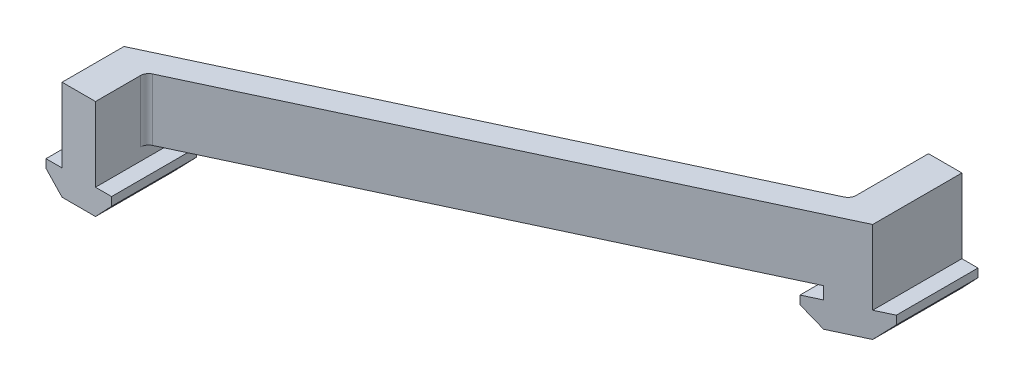
ISO-10303-21;
HEADER;
FILE_DESCRIPTION(('STEP AP214'),'2;1');
FILE_NAME('part.step','',(''),(''),'','','');
FILE_SCHEMA(('AUTOMOTIVE_DESIGN { 1 0 10303 214 1 1 1 1 }'));
ENDSEC;
DATA;
#1=APPLICATION_CONTEXT('core data for automotive mechanical design processes');
#2=APPLICATION_PROTOCOL_DEFINITION('international standard','automotive_design',2000,#1);
#3=PRODUCT_CONTEXT('',#1,'mechanical');
#4=PRODUCT('Part','Part','',(#3));
#5=PRODUCT_RELATED_PRODUCT_CATEGORY('part','',(#4));
#6=PRODUCT_DEFINITION_FORMATION('','',#4);
#7=PRODUCT_DEFINITION_CONTEXT('part definition',#1,'design');
#8=PRODUCT_DEFINITION('design','',#6,#7);
#9=PRODUCT_DEFINITION_SHAPE('','',#8);
#10=(LENGTH_UNIT() NAMED_UNIT(*) SI_UNIT(.MILLI.,.METRE.));
#11=(NAMED_UNIT(*) PLANE_ANGLE_UNIT() SI_UNIT($,.RADIAN.));
#12=(NAMED_UNIT(*) SI_UNIT($,.STERADIAN.) SOLID_ANGLE_UNIT());
#13=UNCERTAINTY_MEASURE_WITH_UNIT(LENGTH_MEASURE(1.E-05),#10,'distance_accuracy_value','');
#14=(GEOMETRIC_REPRESENTATION_CONTEXT(3) GLOBAL_UNCERTAINTY_ASSIGNED_CONTEXT((#13)) GLOBAL_UNIT_ASSIGNED_CONTEXT((#10,
#11,#12)) REPRESENTATION_CONTEXT('',''));
#15=CARTESIAN_POINT('',(0.,0.,0.));
#16=DIRECTION('',(0.,0.,1.));
#17=DIRECTION('',(1.,0.,0.));
#18=AXIS2_PLACEMENT_3D('',#15,#16,#17);
#19=CARTESIAN_POINT('',(0.728649883730893,-6.1524149839237,1.55566750176542));
#20=DIRECTION('',(-0.424162175987541,0.,-0.9055862457334));
#21=DIRECTION('',(-0.9055862457334,0.,0.424162175987541));
#22=AXIS2_PLACEMENT_3D('',#19,#20,#21);
#23=PLANE('',#22);
#24=DIRECTION('',(-0.9055862457334,0.,0.424162175987541));
#25=VECTOR('',#24,1.);
#26=CARTESIAN_POINT('',(0.728649883730893,-6.1524149839237,1.55566750176542));
#27=LINE('',#26,#25);
#28=CARTESIAN_POINT('',(4.04799999999999,-6.15241498392369,0.000936768149918232));
#29=VERTEX_POINT('',#28);
#30=CARTESIAN_POINT('',(-4.048,-6.15241498392371,3.79297423887591));
#31=VERTEX_POINT('',#30);
#32=EDGE_CURVE('E348',#29,#31,#27,.T.);
#33=ORIENTED_EDGE('',*,*,#32,.T.);
#34=DIRECTION('',(0.905586220574988,0.00023571742963929,-0.424162164203742));
#35=VECTOR('',#34,1.);
#36=CARTESIAN_POINT('',(0.728649618327297,-6.15117165717609,1.55566762607624));
#37=LINE('',#36,#35);
#38=CARTESIAN_POINT('',(4.05000000000006,-6.15030713411124,0.));
#39=VERTEX_POINT('',#38);
#40=EDGE_CURVE('E440',#31,#39,#37,.T.);
#41=ORIENTED_EDGE('',*,*,#40,.T.);
#42=DIRECTION('',(0.655101911491755,0.690428220608852,-0.306839302806443));
#43=VECTOR('',#42,1.);
#44=CARTESIAN_POINT('',(-6.96696368434923,-17.7613595515539,5.16017034395753));
#45=LINE('',#44,#43);
#46=EDGE_CURVE('E357',#29,#39,#45,.T.);
#47=ORIENTED_EDGE('',*,*,#46,.F.);
#48=EDGE_LOOP('',(#33,#41,#47));
#49=FACE_BOUND('',#48,.T.);
#50=ADVANCED_FACE('F69',(#49),#23,.T.);
#51=DIRECTION('',(-0.9055862457334,0.,0.424162175987541));
#52=VECTOR('',#51,1.);
#53=CARTESIAN_POINT('',(0.728649883730827,18.,1.55566750176542));
#54=LINE('',#53,#52);
#55=CARTESIAN_POINT('',(-5.20167564802492,18.,4.33333754005851));
#56=VERTEX_POINT('',#55);
#57=CARTESIAN_POINT('',(-124.05,17.9999999999997,60.));
#58=VERTEX_POINT('',#57);
#59=EDGE_CURVE('E334',#56,#58,#54,.T.);
#60=ORIENTED_EDGE('',*,*,#59,.F.);
#61=DIRECTION('',(0.,-1.,0.));
#62=VECTOR('',#61,1.);
#63=CARTESIAN_POINT('',(-5.20167564802492,-6.15241498392369,4.33333754005854));
#64=LINE('',#63,#62);
#65=CARTESIAN_POINT('',(-5.20167564802491,3.00000000000001,4.33333754005852));
#66=VERTEX_POINT('',#65);
#67=EDGE_CURVE('E310',#56,#66,#64,.T.);
#68=ORIENTED_EDGE('',*,*,#67,.T.);
#69=DIRECTION('',(-0.9055862457334,0.,0.424162175987541));
#70=VECTOR('',#69,1.);
#71=CARTESIAN_POINT('',(-22.3182760683492,3.00000000000001,12.3504805940746));
#72=LINE('',#71,#70);
#73=CARTESIAN_POINT('',(-115.95,3.,56.2060889929743));
#74=VERTEX_POINT('',#73);
#75=EDGE_CURVE('E354',#66,#74,#72,.T.);
#76=ORIENTED_EDGE('',*,*,#75,.T.);
#77=DIRECTION('',(0.,1.,0.));
#78=VECTOR('',#77,1.);
#79=CARTESIAN_POINT('',(-115.95,0.,56.2060889929743));
#80=LINE('',#79,#78);
#81=CARTESIAN_POINT('',(-115.95,0.,56.2060889929743));
#82=VERTEX_POINT('',#81);
#83=EDGE_CURVE('E458',#82,#74,#80,.T.);
#84=ORIENTED_EDGE('',*,*,#83,.F.);
#85=DIRECTION('',(0.9055862457334,0.,-0.424162175987541));
#86=VECTOR('',#85,1.);
#87=CARTESIAN_POINT('',(-119.970694106482,0.,58.0893180826613));
#88=LINE('',#87,#86);
#89=CARTESIAN_POINT('',(-112.05,0.,54.3793911007026));
#90=VERTEX_POINT('',#89);
#91=EDGE_CURVE('E307',#82,#90,#88,.T.);
#92=ORIENTED_EDGE('',*,*,#91,.T.);
#93=DIRECTION('',(0.,-1.,0.));
#94=VECTOR('',#93,1.);
#95=CARTESIAN_POINT('',(-112.05,-2.04000000000002,54.3793911007026));
#96=LINE('',#95,#94);
#97=CARTESIAN_POINT('',(-112.05,-2.04,54.3793911007026));
#98=VERTEX_POINT('',#97);
#99=EDGE_CURVE('E452',#90,#98,#96,.T.);
#100=ORIENTED_EDGE('',*,*,#99,.T.);
#101=DIRECTION('',(-0.655101911491755,-0.690428220608851,0.306839302806444));
#102=VECTOR('',#101,1.);
#103=CARTESIAN_POINT('',(-119.729594803873,-10.1337162331902,57.9763910088397));
#104=LINE('',#103,#102);
#105=CARTESIAN_POINT('',(-115.952,-6.15241498392406,56.2070257611243));
#106=VERTEX_POINT('',#105);
#107=EDGE_CURVE('E455',#98,#106,#104,.T.);
#108=ORIENTED_EDGE('',*,*,#107,.T.);
#109=DIRECTION('',(-0.9055862457334,0.,0.424162175987541));
#110=VECTOR('',#109,1.);
#111=CARTESIAN_POINT('',(4.05000000000006,-6.15241498392373,0.));
#112=LINE('',#111,#110);
#113=CARTESIAN_POINT('',(-124.048,-6.15241498392408,59.9990632318502));
#114=VERTEX_POINT('',#113);
#115=EDGE_CURVE('E449',#106,#114,#112,.T.);
#116=ORIENTED_EDGE('',*,*,#115,.T.);
#117=DIRECTION('',(-0.655101911491756,0.69042822060885,0.306839302806443));
#118=VECTOR('',#117,1.);
#119=CARTESIAN_POINT('',(-130.597978811627,0.750770820617105,63.0669689984202));
#120=LINE('',#119,#118);
#121=CARTESIAN_POINT('',(-127.95,-2.04,61.8266978922717));
#122=VERTEX_POINT('',#121);
#123=EDGE_CURVE('E461',#114,#122,#120,.T.);
#124=ORIENTED_EDGE('',*,*,#123,.T.);
#125=DIRECTION('',(0.,1.,0.));
#126=VECTOR('',#125,1.);
#127=CARTESIAN_POINT('',(-127.95,0.,61.8266978922717));
#128=LINE('',#127,#126);
#129=CARTESIAN_POINT('',(-127.95,0.,61.8266978922717));
#130=VERTEX_POINT('',#129);
#131=EDGE_CURVE('E464',#122,#130,#128,.T.);
#132=ORIENTED_EDGE('',*,*,#131,.T.);
#133=DIRECTION('',(0.9055862457334,0.,-0.424162175987541));
#134=VECTOR('',#133,1.);
#135=CARTESIAN_POINT('',(-129.81173148802,0.,62.6987032730773));
#136=LINE('',#135,#134);
#137=CARTESIAN_POINT('',(-124.05,0.,60.));
#138=VERTEX_POINT('',#137);
#139=EDGE_CURVE('E467',#130,#138,#136,.T.);
#140=ORIENTED_EDGE('',*,*,#139,.T.);
#141=DIRECTION('',(0.,1.,0.));
#142=VECTOR('',#141,1.);
#143=CARTESIAN_POINT('',(-124.05,18.,60.));
#144=LINE('',#143,#142);
#145=EDGE_CURVE('E345',#138,#58,#144,.T.);
#146=ORIENTED_EDGE('',*,*,#145,.T.);
#147=EDGE_LOOP('',(#60,#68,#76,#84,#92,#100,#108,#116,#124,#132,#140,#146));
#148=FACE_BOUND('',#147,.T.);
#149=ADVANCED_FACE('F342',(#148),#23,.T.);
#150=CARTESIAN_POINT('',(3.27362293965614,-6.15241498392369,6.98918497616583));
#151=DIRECTION('',(-0.424162175987541,0.,-0.9055862457334));
#152=DIRECTION('',(-0.9055862457334,0.,0.424162175987541));
#153=AXIS2_PLACEMENT_3D('',#150,#151,#152);
#154=PLANE('',#153);
#155=DIRECTION('',(-0.9055862457334,0.,0.424162175987541));
#156=VECTOR('',#155,1.);
#157=CARTESIAN_POINT('',(3.27362293965608,18.,6.98918497616583));
#158=LINE('',#157,#156);
#159=CARTESIAN_POINT('',(4.05,18.,6.62554232495087));
#160=VERTEX_POINT('',#159);
#161=CARTESIAN_POINT('',(-114.798324351975,17.9999999999997,62.2922047848924));
#162=VERTEX_POINT('',#161);
#163=EDGE_CURVE('E237',#160,#162,#158,.T.);
#164=ORIENTED_EDGE('',*,*,#163,.T.);
#165=DIRECTION('',(0.,1.,0.));
#166=VECTOR('',#165,1.);
#167=CARTESIAN_POINT('',(-114.798324351975,-6.15241498392362,62.2922047848924));
#168=LINE('',#167,#166);
#169=CARTESIAN_POINT('',(-114.798324351975,3.,62.2922047848924));
#170=VERTEX_POINT('',#169);
#171=EDGE_CURVE('E91',#162,#170,#168,.F.);
#172=ORIENTED_EDGE('',*,*,#171,.T.);
#173=DIRECTION('',(-0.9055862457334,0.,0.424162175987541));
#174=VECTOR('',#173,1.);
#175=CARTESIAN_POINT('',(-19.7733030124239,3.00000000000001,17.783998068475));
#176=LINE('',#175,#174);
#177=CARTESIAN_POINT('',(-4.05,3.00000000000001,10.4194533319766));
#178=VERTEX_POINT('',#177);
#179=EDGE_CURVE('E270',#178,#170,#176,.T.);
#180=ORIENTED_EDGE('',*,*,#179,.F.);
#181=DIRECTION('',(0.,1.,0.));
#182=VECTOR('',#181,1.);
#183=CARTESIAN_POINT('',(-4.05,0.,10.4194533319766));
#184=LINE('',#183,#182);
#185=CARTESIAN_POINT('',(-4.05,0.,10.4194533319766));
#186=VERTEX_POINT('',#185);
#187=EDGE_CURVE('E910',#186,#178,#184,.T.);
#188=ORIENTED_EDGE('',*,*,#187,.F.);
#189=DIRECTION('',(-0.9055862457334,0.,0.424162175987541));
#190=VECTOR('',#189,1.);
#191=CARTESIAN_POINT('',(-19.7733030124239,0.,17.783998068475));
#192=LINE('',#191,#190);
#193=CARTESIAN_POINT('',(-7.95,0.,12.2461512242483));
#194=VERTEX_POINT('',#193);
#195=EDGE_CURVE('E904',#186,#194,#192,.T.);
#196=ORIENTED_EDGE('',*,*,#195,.T.);
#197=DIRECTION('',(0.,1.,0.));
#198=VECTOR('',#197,1.);
#199=CARTESIAN_POINT('',(-7.95,-6.15241498392408,12.2461512242483));
#200=LINE('',#199,#198);
#201=CARTESIAN_POINT('',(-7.95,-2.04,12.2461512242483));
#202=VERTEX_POINT('',#201);
#203=EDGE_CURVE('E950',#202,#194,#200,.T.);
#204=ORIENTED_EDGE('',*,*,#203,.F.);
#205=DIRECTION('',(0.655101911491755,-0.690428220608852,-0.306839302806443));
#206=VECTOR('',#205,1.);
#207=CARTESIAN_POINT('',(-15.0599330929756,5.45333556797741,15.5763306588973));
#208=LINE('',#207,#206);
#209=CARTESIAN_POINT('',(-4.048,-6.15241498392371,10.4185165638268));
#210=VERTEX_POINT('',#209);
#211=EDGE_CURVE('E256',#202,#210,#208,.T.);
#212=ORIENTED_EDGE('',*,*,#211,.T.);
#213=DIRECTION('',(-0.9055862457334,0.,0.424162175987541));
#214=VECTOR('',#213,1.);
#215=CARTESIAN_POINT('',(3.27362293965614,-6.15241498392369,6.98918497616583));
#216=LINE('',#215,#214);
#217=CARTESIAN_POINT('',(4.04799999999999,-6.15241498392369,6.62647909310079));
#218=VERTEX_POINT('',#217);
#219=EDGE_CURVE('E245',#218,#210,#216,.T.);
#220=ORIENTED_EDGE('',*,*,#219,.F.);
#221=DIRECTION('',(0.655101911491755,0.690428220608851,-0.306839302806443));
#222=VECTOR('',#221,1.);
#223=CARTESIAN_POINT('',(-5.63515670470695,-16.3577350054813,11.1619154887481));
#224=LINE('',#223,#222);
#225=CARTESIAN_POINT('',(7.95,-2.04,4.79884443267921));
#226=VERTEX_POINT('',#225);
#227=EDGE_CURVE('E264',#218,#226,#224,.T.);
#228=ORIENTED_EDGE('',*,*,#227,.T.);
#229=DIRECTION('',(0.,1.,0.));
#230=VECTOR('',#229,1.);
#231=CARTESIAN_POINT('',(7.95,-6.15241498392408,4.79884443267921));
#232=LINE('',#231,#230);
#233=CARTESIAN_POINT('',(7.95,0.,4.79884443267921));
#234=VERTEX_POINT('',#233);
#235=EDGE_CURVE('E949',#226,#234,#232,.T.);
#236=ORIENTED_EDGE('',*,*,#235,.T.);
#237=DIRECTION('',(-0.9055862457334,0.,0.424162175987541));
#238=VECTOR('',#237,1.);
#239=CARTESIAN_POINT('',(-19.7733030124239,0.,17.783998068475));
#240=LINE('',#239,#238);
#241=CARTESIAN_POINT('',(4.05,0.,6.62554232495087));
#242=VERTEX_POINT('',#241);
#243=EDGE_CURVE('E252',#234,#242,#240,.T.);
#244=ORIENTED_EDGE('',*,*,#243,.T.);
#245=DIRECTION('',(0.,1.,0.));
#246=VECTOR('',#245,1.);
#247=CARTESIAN_POINT('',(4.05,0.,6.62554232495087));
#248=LINE('',#247,#246);
#249=EDGE_CURVE('E249',#242,#160,#248,.T.);
#250=ORIENTED_EDGE('',*,*,#249,.T.);
#251=EDGE_LOOP('',(#164,#172,#180,#188,#196,#204,#212,#220,#228,#236,#244,#250));
#252=FACE_BOUND('',#251,.T.);
#253=ADVANCED_FACE('F250',(#252),#154,.F.);
#254=CARTESIAN_POINT('',(-115.95,0.,60.));
#255=DIRECTION('',(1.,0.,0.));
#256=DIRECTION('',(0.,0.,-1.));
#257=AXIS2_PLACEMENT_3D('',#254,#255,#256);
#258=PLANE('',#257);
#259=DIRECTION('',(0.,0.,-1.));
#260=VECTOR('',#259,1.);
#261=CARTESIAN_POINT('',(-115.95,3.,60.));
#262=LINE('',#261,#260);
#263=CARTESIAN_POINT('',(-115.95,3.,64.1033772763592));
#264=VERTEX_POINT('',#263);
#265=EDGE_CURVE('E299',#264,#74,#262,.T.);
#266=ORIENTED_EDGE('',*,*,#265,.F.);
#267=DIRECTION('',(0.,1.,0.));
#268=VECTOR('',#267,1.);
#269=CARTESIAN_POINT('',(-115.95,0.,64.1033772763592));
#270=LINE('',#269,#268);
#271=CARTESIAN_POINT('',(-115.95,18.,64.1033772763592));
#272=VERTEX_POINT('',#271);
#273=EDGE_CURVE('E317',#264,#272,#270,.T.);
#274=ORIENTED_EDGE('',*,*,#273,.T.);
#275=DIRECTION('',(0.,0.,-1.));
#276=VECTOR('',#275,1.);
#277=CARTESIAN_POINT('',(-115.95,18.,75.));
#278=LINE('',#277,#276);
#279=CARTESIAN_POINT('',(-115.95,18.,75.));
#280=VERTEX_POINT('',#279);
#281=EDGE_CURVE('E371',#280,#272,#278,.T.);
#282=ORIENTED_EDGE('',*,*,#281,.F.);
#283=DIRECTION('',(0.,1.,0.));
#284=VECTOR('',#283,1.);
#285=CARTESIAN_POINT('',(-115.95,0.,75.));
#286=LINE('',#285,#284);
#287=CARTESIAN_POINT('',(-115.95,0.,75.));
#288=VERTEX_POINT('',#287);
#289=EDGE_CURVE('E377',#288,#280,#286,.T.);
#290=ORIENTED_EDGE('',*,*,#289,.F.);
#291=DIRECTION('',(0.,0.,-1.));
#292=VECTOR('',#291,1.);
#293=CARTESIAN_POINT('',(-115.95,0.,60.));
#294=LINE('',#293,#292);
#295=EDGE_CURVE('E303',#288,#82,#294,.T.);
#296=ORIENTED_EDGE('',*,*,#295,.T.);
#297=ORIENTED_EDGE('',*,*,#83,.T.);
#298=EDGE_LOOP('',(#266,#274,#282,#290,#296,#297));
#299=FACE_BOUND('',#298,.T.);
#300=ADVANCED_FACE('F369',(#299),#258,.T.);
#301=CARTESIAN_POINT('',(0.,18.,60.));
#302=DIRECTION('',(0.,-1.,0.));
#303=DIRECTION('',(1.,0.,0.));
#304=AXIS2_PLACEMENT_3D('',#301,#302,#303);
#305=PLANE('',#304);
#306=ORIENTED_EDGE('',*,*,#163,.F.);
#307=DIRECTION('',(0.,0.,-1.));
#308=VECTOR('',#307,1.);
#309=CARTESIAN_POINT('',(4.05,18.,60.));
#310=LINE('',#309,#308);
#311=CARTESIAN_POINT('',(4.05,18.,-15.));
#312=VERTEX_POINT('',#311);
#313=EDGE_CURVE('E242',#160,#312,#310,.T.);
#314=ORIENTED_EDGE('',*,*,#313,.T.);
#315=DIRECTION('',(1.,0.,0.));
#316=VECTOR('',#315,1.);
#317=CARTESIAN_POINT('',(-4.05,18.,-15.));
#318=LINE('',#317,#316);
#319=CARTESIAN_POINT('',(-4.05,18.,-15.));
#320=VERTEX_POINT('',#319);
#321=EDGE_CURVE('E442',#320,#312,#318,.T.);
#322=ORIENTED_EDGE('',*,*,#321,.F.);
#323=DIRECTION('',(0.,0.,1.));
#324=VECTOR('',#323,1.);
#325=CARTESIAN_POINT('',(-4.05,18.,-15.));
#326=LINE('',#325,#324);
#327=CARTESIAN_POINT('',(-4.05,18.,2.52216504859171));
#328=VERTEX_POINT('',#327);
#329=EDGE_CURVE('E337',#320,#328,#326,.T.);
#330=ORIENTED_EDGE('',*,*,#329,.T.);
#331=CARTESIAN_POINT('',(-6.05,18.,2.52216504859171));
#332=DIRECTION('',(0.,-1.,0.));
#333=DIRECTION('',(1.,0.,0.));
#334=AXIS2_PLACEMENT_3D('',#331,#332,#333);
#335=CIRCLE('',#334,2.);
#336=EDGE_CURVE('E327',#328,#56,#335,.T.);
#337=ORIENTED_EDGE('',*,*,#336,.T.);
#338=ORIENTED_EDGE('',*,*,#59,.T.);
#339=DIRECTION('',(0.,0.,-1.));
#340=VECTOR('',#339,1.);
#341=CARTESIAN_POINT('',(-124.05,18.,75.));
#342=LINE('',#341,#340);
#343=CARTESIAN_POINT('',(-124.05,18.,75.));
#344=VERTEX_POINT('',#343);
#345=EDGE_CURVE('E246',#344,#58,#342,.T.);
#346=ORIENTED_EDGE('',*,*,#345,.F.);
#347=DIRECTION('',(-1.,0.,0.));
#348=VECTOR('',#347,1.);
#349=CARTESIAN_POINT('',(-115.95,18.,75.));
#350=LINE('',#349,#348);
#351=EDGE_CURVE('E374',#280,#344,#350,.T.);
#352=ORIENTED_EDGE('',*,*,#351,.F.);
#353=ORIENTED_EDGE('',*,*,#281,.T.);
#354=CARTESIAN_POINT('',(-113.95,18.,64.1033772763592));
#355=DIRECTION('',(0.,-1.,0.));
#356=DIRECTION('',(1.,0.,0.));
#357=AXIS2_PLACEMENT_3D('',#354,#355,#356);
#358=CIRCLE('',#357,2.);
#359=EDGE_CURVE('E78',#272,#162,#358,.T.);
#360=ORIENTED_EDGE('',*,*,#359,.T.);
#361=EDGE_LOOP('',(#306,#314,#322,#330,#337,#338,#346,#352,#353,#360));
#362=FACE_BOUND('',#361,.T.);
#363=ADVANCED_FACE('F239',(#362),#305,.F.);
#364=CARTESIAN_POINT('',(-124.05,18.,75.));
#365=DIRECTION('',(1.,0.,0.));
#366=DIRECTION('',(0.,0.,-1.));
#367=AXIS2_PLACEMENT_3D('',#364,#365,#366);
#368=PLANE('',#367);
#369=ORIENTED_EDGE('',*,*,#145,.F.);
#370=DIRECTION('',(0.,0.,-1.));
#371=VECTOR('',#370,1.);
#372=CARTESIAN_POINT('',(-124.05,0.,75.));
#373=LINE('',#372,#371);
#374=CARTESIAN_POINT('',(-124.05,0.,75.));
#375=VERTEX_POINT('',#374);
#376=EDGE_CURVE('E407',#375,#138,#373,.T.);
#377=ORIENTED_EDGE('',*,*,#376,.F.);
#378=DIRECTION('',(0.,-1.,0.));
#379=VECTOR('',#378,1.);
#380=CARTESIAN_POINT('',(-124.05,18.,75.));
#381=LINE('',#380,#379);
#382=EDGE_CURVE('E474',#344,#375,#381,.T.);
#383=ORIENTED_EDGE('',*,*,#382,.F.);
#384=ORIENTED_EDGE('',*,*,#345,.T.);
#385=EDGE_LOOP('',(#369,#377,#383,#384));
#386=FACE_BOUND('',#385,.T.);
#387=ADVANCED_FACE('F534',(#386),#368,.F.);
#388=CARTESIAN_POINT('',(-124.05,0.,75.));
#389=DIRECTION('',(0.,-1.,0.));
#390=DIRECTION('',(1.,0.,0.));
#391=AXIS2_PLACEMENT_3D('',#388,#389,#390);
#392=PLANE('',#391);
#393=ORIENTED_EDGE('',*,*,#139,.F.);
#394=DIRECTION('',(0.,0.,-1.));
#395=VECTOR('',#394,1.);
#396=CARTESIAN_POINT('',(-127.95,0.,75.));
#397=LINE('',#396,#395);
#398=CARTESIAN_POINT('',(-127.95,0.,75.));
#399=VERTEX_POINT('',#398);
#400=EDGE_CURVE('E403',#399,#130,#397,.T.);
#401=ORIENTED_EDGE('',*,*,#400,.F.);
#402=DIRECTION('',(-1.,0.,0.));
#403=VECTOR('',#402,1.);
#404=CARTESIAN_POINT('',(-124.05,0.,75.));
#405=LINE('',#404,#403);
#406=EDGE_CURVE('E477',#375,#399,#405,.T.);
#407=ORIENTED_EDGE('',*,*,#406,.F.);
#408=ORIENTED_EDGE('',*,*,#376,.T.);
#409=EDGE_LOOP('',(#393,#401,#407,#408));
#410=FACE_BOUND('',#409,.T.);
#411=ADVANCED_FACE('F531',(#410),#392,.F.);
#412=CARTESIAN_POINT('',(-127.95,0.,75.));
#413=DIRECTION('',(1.,0.,0.));
#414=DIRECTION('',(0.,0.,-1.));
#415=AXIS2_PLACEMENT_3D('',#412,#413,#414);
#416=PLANE('',#415);
#417=ORIENTED_EDGE('',*,*,#131,.F.);
#418=DIRECTION('',(0.,0.,-1.));
#419=VECTOR('',#418,1.);
#420=CARTESIAN_POINT('',(-127.95,-2.04,75.));
#421=LINE('',#420,#419);
#422=CARTESIAN_POINT('',(-127.95,-2.04,75.));
#423=VERTEX_POINT('',#422);
#424=EDGE_CURVE('E399',#423,#122,#421,.T.);
#425=ORIENTED_EDGE('',*,*,#424,.F.);
#426=DIRECTION('',(0.,-1.,0.));
#427=VECTOR('',#426,1.);
#428=CARTESIAN_POINT('',(-127.95,0.,75.));
#429=LINE('',#428,#427);
#430=EDGE_CURVE('E480',#399,#423,#429,.T.);
#431=ORIENTED_EDGE('',*,*,#430,.F.);
#432=ORIENTED_EDGE('',*,*,#400,.T.);
#433=EDGE_LOOP('',(#417,#425,#431,#432));
#434=FACE_BOUND('',#433,.T.);
#435=ADVANCED_FACE('F526',(#434),#416,.F.);
#436=CARTESIAN_POINT('',(-127.95,-2.04,75.));
#437=DIRECTION('',(0.725421588273712,0.68830481566414,0.));
#438=DIRECTION('',(-0.68830481566414,0.725421588273712,0.));
#439=AXIS2_PLACEMENT_3D('',#436,#437,#438);
#440=PLANE('',#439);
#441=ORIENTED_EDGE('',*,*,#123,.F.);
#442=DIRECTION('',(0.,0.,-1.));
#443=VECTOR('',#442,1.);
#444=CARTESIAN_POINT('',(-124.048,-6.15241498392368,75.));
#445=LINE('',#444,#443);
#446=CARTESIAN_POINT('',(-124.048,-6.15241498392368,75.));
#447=VERTEX_POINT('',#446);
#448=EDGE_CURVE('E395',#447,#114,#445,.T.);
#449=ORIENTED_EDGE('',*,*,#448,.F.);
#450=DIRECTION('',(0.68830481566414,-0.725421588273712,0.));
#451=VECTOR('',#450,1.);
#452=CARTESIAN_POINT('',(-127.95,-2.04,75.));
#453=LINE('',#452,#451);
#454=EDGE_CURVE('E483',#423,#447,#453,.T.);
#455=ORIENTED_EDGE('',*,*,#454,.F.);
#456=ORIENTED_EDGE('',*,*,#424,.T.);
#457=EDGE_LOOP('',(#441,#449,#455,#456));
#458=FACE_BOUND('',#457,.T.);
#459=ADVANCED_FACE('F521',(#458),#440,.F.);
#460=CARTESIAN_POINT('',(-124.048,-6.15241498392368,75.));
#461=DIRECTION('',(0.,1.,0.));
#462=DIRECTION('',(-1.,0.,0.));
#463=AXIS2_PLACEMENT_3D('',#460,#461,#462);
#464=PLANE('',#463);
#465=ORIENTED_EDGE('',*,*,#115,.F.);
#466=DIRECTION('',(0.,0.,-1.));
#467=VECTOR('',#466,1.);
#468=CARTESIAN_POINT('',(-115.952,-6.15241498392368,75.));
#469=LINE('',#468,#467);
#470=CARTESIAN_POINT('',(-115.952,-6.15241498392368,75.));
#471=VERTEX_POINT('',#470);
#472=EDGE_CURVE('E391',#471,#106,#469,.T.);
#473=ORIENTED_EDGE('',*,*,#472,.F.);
#474=DIRECTION('',(1.,0.,0.));
#475=VECTOR('',#474,1.);
#476=CARTESIAN_POINT('',(-124.048,-6.15241498392368,75.));
#477=LINE('',#476,#475);
#478=EDGE_CURVE('E486',#447,#471,#477,.T.);
#479=ORIENTED_EDGE('',*,*,#478,.F.);
#480=ORIENTED_EDGE('',*,*,#448,.T.);
#481=EDGE_LOOP('',(#465,#473,#479,#480));
#482=FACE_BOUND('',#481,.T.);
#483=ADVANCED_FACE('F516',(#482),#464,.F.);
#484=CARTESIAN_POINT('',(-115.952,-6.15241498392368,75.));
#485=DIRECTION('',(-0.725421588273713,0.688304815664138,0.));
#486=DIRECTION('',(-0.688304815664138,-0.725421588273713,0.));
#487=AXIS2_PLACEMENT_3D('',#484,#485,#486);
#488=PLANE('',#487);
#489=ORIENTED_EDGE('',*,*,#107,.F.);
#490=DIRECTION('',(0.,0.,-1.));
#491=VECTOR('',#490,1.);
#492=CARTESIAN_POINT('',(-112.05,-2.04,75.));
#493=LINE('',#492,#491);
#494=CARTESIAN_POINT('',(-112.05,-2.04,75.));
#495=VERTEX_POINT('',#494);
#496=EDGE_CURVE('E382',#495,#98,#493,.T.);
#497=ORIENTED_EDGE('',*,*,#496,.F.);
#498=DIRECTION('',(0.688304815664138,0.725421588273713,0.));
#499=VECTOR('',#498,1.);
#500=CARTESIAN_POINT('',(-115.952,-6.15241498392368,75.));
#501=LINE('',#500,#499);
#502=EDGE_CURVE('E489',#471,#495,#501,.T.);
#503=ORIENTED_EDGE('',*,*,#502,.F.);
#504=ORIENTED_EDGE('',*,*,#472,.T.);
#505=EDGE_LOOP('',(#489,#497,#503,#504));
#506=FACE_BOUND('',#505,.T.);
#507=ADVANCED_FACE('F511',(#506),#488,.F.);
#508=CARTESIAN_POINT('',(-112.05,-2.04,75.));
#509=DIRECTION('',(-1.,0.,0.));
#510=DIRECTION('',(0.,0.,1.));
#511=AXIS2_PLACEMENT_3D('',#508,#509,#510);
#512=PLANE('',#511);
#513=ORIENTED_EDGE('',*,*,#99,.F.);
#514=DIRECTION('',(0.,0.,-1.));
#515=VECTOR('',#514,1.);
#516=CARTESIAN_POINT('',(-112.05,0.,75.));
#517=LINE('',#516,#515);
#518=CARTESIAN_POINT('',(-112.05,0.,75.));
#519=VERTEX_POINT('',#518);
#520=EDGE_CURVE('E376',#519,#90,#517,.T.);
#521=ORIENTED_EDGE('',*,*,#520,.F.);
#522=DIRECTION('',(0.,1.,0.));
#523=VECTOR('',#522,1.);
#524=CARTESIAN_POINT('',(-112.05,-2.04,75.));
#525=LINE('',#524,#523);
#526=EDGE_CURVE('E492',#495,#519,#525,.T.);
#527=ORIENTED_EDGE('',*,*,#526,.F.);
#528=ORIENTED_EDGE('',*,*,#496,.T.);
#529=EDGE_LOOP('',(#513,#521,#527,#528));
#530=FACE_BOUND('',#529,.T.);
#531=ADVANCED_FACE('F507',(#530),#512,.F.);
#532=CARTESIAN_POINT('',(-112.05,0.,75.));
#533=DIRECTION('',(0.,-1.,0.));
#534=DIRECTION('',(1.,0.,0.));
#535=AXIS2_PLACEMENT_3D('',#532,#533,#534);
#536=PLANE('',#535);
#537=ORIENTED_EDGE('',*,*,#91,.F.);
#538=ORIENTED_EDGE('',*,*,#295,.F.);
#539=DIRECTION('',(-1.,0.,0.));
#540=VECTOR('',#539,1.);
#541=CARTESIAN_POINT('',(-112.05,0.,75.));
#542=LINE('',#541,#540);
#543=EDGE_CURVE('E384',#519,#288,#542,.T.);
#544=ORIENTED_EDGE('',*,*,#543,.F.);
#545=ORIENTED_EDGE('',*,*,#520,.T.);
#546=EDGE_LOOP('',(#537,#538,#544,#545));
#547=FACE_BOUND('',#546,.T.);
#548=ADVANCED_FACE('F503',(#547),#536,.F.);
#549=CARTESIAN_POINT('',(0.,3.00000000000002,60.));
#550=DIRECTION('',(0.,1.,0.));
#551=DIRECTION('',(-1.,0.,0.));
#552=AXIS2_PLACEMENT_3D('',#549,#550,#551);
#553=PLANE('',#552);
#554=DIRECTION('',(0.,0.,-1.));
#555=VECTOR('',#554,1.);
#556=CARTESIAN_POINT('',(-4.05,3.00000000000001,60.));
#557=LINE('',#556,#555);
#558=CARTESIAN_POINT('',(-4.05,3.00000000000001,2.52216504859173));
#559=VERTEX_POINT('',#558);
#560=EDGE_CURVE('E296',#178,#559,#557,.T.);
#561=ORIENTED_EDGE('',*,*,#560,.F.);
#562=ORIENTED_EDGE('',*,*,#179,.T.);
#563=CARTESIAN_POINT('',(-113.95,3.,64.1033772763592));
#564=DIRECTION('',(0.,1.,0.));
#565=DIRECTION('',(-1.,0.,0.));
#566=AXIS2_PLACEMENT_3D('',#563,#564,#565);
#567=CIRCLE('',#566,2.);
#568=EDGE_CURVE('E12',#170,#264,#567,.T.);
#569=ORIENTED_EDGE('',*,*,#568,.T.);
#570=ORIENTED_EDGE('',*,*,#265,.T.);
#571=ORIENTED_EDGE('',*,*,#75,.F.);
#572=CARTESIAN_POINT('',(-6.05,3.00000000000001,2.52216504859173));
#573=DIRECTION('',(0.,1.,0.));
#574=DIRECTION('',(-1.,0.,0.));
#575=AXIS2_PLACEMENT_3D('',#572,#573,#574);
#576=CIRCLE('',#575,2.);
#577=EDGE_CURVE('E323',#66,#559,#576,.T.);
#578=ORIENTED_EDGE('',*,*,#577,.T.);
#579=EDGE_LOOP('',(#561,#562,#569,#570,#571,#578));
#580=FACE_BOUND('',#579,.T.);
#581=ADVANCED_FACE('F353',(#580),#553,.F.);
#582=CARTESIAN_POINT('',(-4.05,0.,60.));
#583=DIRECTION('',(1.,0.,0.));
#584=DIRECTION('',(0.,1.,0.));
#585=AXIS2_PLACEMENT_3D('',#582,#583,#584);
#586=PLANE('',#585);
#587=ORIENTED_EDGE('',*,*,#560,.T.);
#588=DIRECTION('',(0.,-1.,0.));
#589=VECTOR('',#588,1.);
#590=CARTESIAN_POINT('',(-4.05,0.,2.52216504859173));
#591=LINE('',#590,#589);
#592=EDGE_CURVE('E314',#559,#328,#591,.F.);
#593=ORIENTED_EDGE('',*,*,#592,.T.);
#594=ORIENTED_EDGE('',*,*,#329,.F.);
#595=DIRECTION('',(0.,1.,0.));
#596=VECTOR('',#595,1.);
#597=CARTESIAN_POINT('',(-4.05,0.,-15.));
#598=LINE('',#597,#596);
#599=CARTESIAN_POINT('',(-4.05,0.,-15.));
#600=VERTEX_POINT('',#599);
#601=EDGE_CURVE('E913',#600,#320,#598,.T.);
#602=ORIENTED_EDGE('',*,*,#601,.F.);
#603=DIRECTION('',(0.,0.,-1.));
#604=VECTOR('',#603,1.);
#605=CARTESIAN_POINT('',(-4.05,0.,60.));
#606=LINE('',#605,#604);
#607=EDGE_CURVE('E293',#186,#600,#606,.T.);
#608=ORIENTED_EDGE('',*,*,#607,.F.);
#609=ORIENTED_EDGE('',*,*,#187,.T.);
#610=EDGE_LOOP('',(#587,#593,#594,#602,#608,#609));
#611=FACE_BOUND('',#610,.T.);
#612=ADVANCED_FACE('F574',(#611),#586,.F.);
#613=CARTESIAN_POINT('',(0.,0.,60.));
#614=DIRECTION('',(0.,1.,0.));
#615=DIRECTION('',(-1.,0.,0.));
#616=AXIS2_PLACEMENT_3D('',#613,#614,#615);
#617=PLANE('',#616);
#618=ORIENTED_EDGE('',*,*,#195,.F.);
#619=ORIENTED_EDGE('',*,*,#607,.T.);
#620=DIRECTION('',(1.,0.,0.));
#621=VECTOR('',#620,1.);
#622=CARTESIAN_POINT('',(-7.95,0.,-15.));
#623=LINE('',#622,#621);
#624=CARTESIAN_POINT('',(-7.95,0.,-15.));
#625=VERTEX_POINT('',#624);
#626=EDGE_CURVE('E915',#625,#600,#623,.T.);
#627=ORIENTED_EDGE('',*,*,#626,.F.);
#628=DIRECTION('',(0.,0.,-1.));
#629=VECTOR('',#628,1.);
#630=CARTESIAN_POINT('',(-7.95,0.,60.));
#631=LINE('',#630,#629);
#632=EDGE_CURVE('E290',#194,#625,#631,.T.);
#633=ORIENTED_EDGE('',*,*,#632,.F.);
#634=EDGE_LOOP('',(#618,#619,#627,#633));
#635=FACE_BOUND('',#634,.T.);
#636=ADVANCED_FACE('F558',(#635),#617,.T.);
#637=CARTESIAN_POINT('',(-7.95,0.,60.));
#638=DIRECTION('',(-1.,0.,0.));
#639=DIRECTION('',(0.,-1.,0.));
#640=AXIS2_PLACEMENT_3D('',#637,#638,#639);
#641=PLANE('',#640);
#642=ORIENTED_EDGE('',*,*,#203,.T.);
#643=ORIENTED_EDGE('',*,*,#632,.T.);
#644=DIRECTION('',(0.,1.,0.));
#645=VECTOR('',#644,1.);
#646=CARTESIAN_POINT('',(-7.95,-2.04,-15.));
#647=LINE('',#646,#645);
#648=CARTESIAN_POINT('',(-7.95,-2.04,-15.));
#649=VERTEX_POINT('',#648);
#650=EDGE_CURVE('E919',#649,#625,#647,.T.);
#651=ORIENTED_EDGE('',*,*,#650,.F.);
#652=DIRECTION('',(0.,0.,-1.));
#653=VECTOR('',#652,1.);
#654=CARTESIAN_POINT('',(-7.95,-2.04,60.));
#655=LINE('',#654,#653);
#656=EDGE_CURVE('E287',#202,#649,#655,.T.);
#657=ORIENTED_EDGE('',*,*,#656,.F.);
#658=EDGE_LOOP('',(#642,#643,#651,#657));
#659=FACE_BOUND('',#658,.T.);
#660=ADVANCED_FACE('F570',(#659),#641,.T.);
#661=CARTESIAN_POINT('',(-5.20217481392665,-4.93600140143796,60.));
#662=DIRECTION('',(-0.725421588273713,-0.688304815664138,0.));
#663=DIRECTION('',(0.688304815664138,-0.725421588273713,0.));
#664=AXIS2_PLACEMENT_3D('',#661,#662,#663);
#665=PLANE('',#664);
#666=ORIENTED_EDGE('',*,*,#211,.F.);
#667=ORIENTED_EDGE('',*,*,#656,.T.);
#668=DIRECTION('',(-0.688304815664136,0.725421588273716,0.));
#669=VECTOR('',#668,1.);
#670=CARTESIAN_POINT('',(-4.048,-6.15241498392371,-15.));
#671=LINE('',#670,#669);
#672=CARTESIAN_POINT('',(-4.048,-6.15241498392371,-15.));
#673=VERTEX_POINT('',#672);
#674=EDGE_CURVE('E431',#673,#649,#671,.T.);
#675=ORIENTED_EDGE('',*,*,#674,.F.);
#676=DIRECTION('',(0.,0.,1.));
#677=VECTOR('',#676,1.);
#678=CARTESIAN_POINT('',(-4.048,-6.15241498392371,-15.));
#679=LINE('',#678,#677);
#680=EDGE_CURVE('E429',#673,#31,#679,.T.);
#681=ORIENTED_EDGE('',*,*,#680,.T.);
#682=DIRECTION('',(0.,0.,-1.));
#683=VECTOR('',#682,1.);
#684=CARTESIAN_POINT('',(-4.048,-6.15241498392368,60.));
#685=LINE('',#684,#683);
#686=EDGE_CURVE('E283',#210,#31,#685,.T.);
#687=ORIENTED_EDGE('',*,*,#686,.F.);
#688=EDGE_LOOP('',(#666,#667,#675,#681,#687));
#689=FACE_BOUND('',#688,.T.);
#690=ADVANCED_FACE('F425',(#689),#665,.T.);
#691=CARTESIAN_POINT('',(0.,-6.15241498392368,60.));
#692=DIRECTION('',(0.,-1.,0.));
#693=DIRECTION('',(1.,0.,0.));
#694=AXIS2_PLACEMENT_3D('',#691,#692,#693);
#695=PLANE('',#694);
#696=ORIENTED_EDGE('',*,*,#219,.T.);
#697=ORIENTED_EDGE('',*,*,#686,.T.);
#698=ORIENTED_EDGE('',*,*,#32,.F.);
#699=DIRECTION('',(0.,0.,-1.));
#700=VECTOR('',#699,1.);
#701=CARTESIAN_POINT('',(4.048,-6.15241498392368,60.));
#702=LINE('',#701,#700);
#703=EDGE_CURVE('E279',#218,#29,#702,.T.);
#704=ORIENTED_EDGE('',*,*,#703,.F.);
#705=EDGE_LOOP('',(#696,#697,#698,#704));
#706=FACE_BOUND('',#705,.T.);
#707=ADVANCED_FACE('F418',(#706),#695,.T.);
#708=CARTESIAN_POINT('',(5.20217481392665,-4.93600140143796,60.));
#709=DIRECTION('',(0.725421588273714,-0.688304815664138,0.));
#710=DIRECTION('',(0.688304815664138,0.725421588273714,0.));
#711=AXIS2_PLACEMENT_3D('',#708,#709,#710);
#712=PLANE('',#711);
#713=DIRECTION('',(0.,0.,-1.));
#714=VECTOR('',#713,1.);
#715=CARTESIAN_POINT('',(7.95,-2.04,60.));
#716=LINE('',#715,#714);
#717=CARTESIAN_POINT('',(7.95,-2.04,-15.));
#718=VERTEX_POINT('',#717);
#719=EDGE_CURVE('E276',#226,#718,#716,.T.);
#720=ORIENTED_EDGE('',*,*,#719,.F.);
#721=ORIENTED_EDGE('',*,*,#227,.F.);
#722=ORIENTED_EDGE('',*,*,#703,.T.);
#723=ORIENTED_EDGE('',*,*,#46,.T.);
#724=DIRECTION('',(0.,0.,1.));
#725=VECTOR('',#724,1.);
#726=CARTESIAN_POINT('',(4.05000000000006,-6.15030713411124,-15.));
#727=LINE('',#726,#725);
#728=CARTESIAN_POINT('',(4.05000000000006,-6.15030713411124,-15.));
#729=VERTEX_POINT('',#728);
#730=EDGE_CURVE('E435',#729,#39,#727,.T.);
#731=ORIENTED_EDGE('',*,*,#730,.F.);
#732=DIRECTION('',(-0.688304815664139,-0.725421588273713,0.));
#733=VECTOR('',#732,1.);
#734=CARTESIAN_POINT('',(7.95,-2.04,-15.));
#735=LINE('',#734,#733);
#736=EDGE_CURVE('E930',#718,#729,#735,.T.);
#737=ORIENTED_EDGE('',*,*,#736,.F.);
#738=EDGE_LOOP('',(#720,#721,#722,#723,#731,#737));
#739=FACE_BOUND('',#738,.T.);
#740=ADVANCED_FACE('F561',(#739),#712,.T.);
#741=CARTESIAN_POINT('',(7.95,0.,60.));
#742=DIRECTION('',(1.,0.,0.));
#743=DIRECTION('',(0.,1.,0.));
#744=AXIS2_PLACEMENT_3D('',#741,#742,#743);
#745=PLANE('',#744);
#746=ORIENTED_EDGE('',*,*,#235,.F.);
#747=ORIENTED_EDGE('',*,*,#719,.T.);
#748=DIRECTION('',(0.,-1.,0.));
#749=VECTOR('',#748,1.);
#750=CARTESIAN_POINT('',(7.95,0.,-15.));
#751=LINE('',#750,#749);
#752=CARTESIAN_POINT('',(7.95,0.,-15.));
#753=VERTEX_POINT('',#752);
#754=EDGE_CURVE('E933',#753,#718,#751,.T.);
#755=ORIENTED_EDGE('',*,*,#754,.F.);
#756=DIRECTION('',(0.,0.,-1.));
#757=VECTOR('',#756,1.);
#758=CARTESIAN_POINT('',(7.95,0.,60.));
#759=LINE('',#758,#757);
#760=EDGE_CURVE('E268',#234,#753,#759,.T.);
#761=ORIENTED_EDGE('',*,*,#760,.F.);
#762=EDGE_LOOP('',(#746,#747,#755,#761));
#763=FACE_BOUND('',#762,.T.);
#764=ADVANCED_FACE('F556',(#763),#745,.T.);
#765=ORIENTED_EDGE('',*,*,#243,.F.);
#766=ORIENTED_EDGE('',*,*,#760,.T.);
#767=DIRECTION('',(1.,0.,0.));
#768=VECTOR('',#767,1.);
#769=CARTESIAN_POINT('',(4.05,0.,-15.));
#770=LINE('',#769,#768);
#771=CARTESIAN_POINT('',(4.05,0.,-15.));
#772=VERTEX_POINT('',#771);
#773=EDGE_CURVE('E937',#772,#753,#770,.T.);
#774=ORIENTED_EDGE('',*,*,#773,.F.);
#775=DIRECTION('',(0.,0.,-1.));
#776=VECTOR('',#775,1.);
#777=CARTESIAN_POINT('',(4.05,0.,60.));
#778=LINE('',#777,#776);
#779=EDGE_CURVE('E263',#242,#772,#778,.T.);
#780=ORIENTED_EDGE('',*,*,#779,.F.);
#781=EDGE_LOOP('',(#765,#766,#774,#780));
#782=FACE_BOUND('',#781,.T.);
#783=ADVANCED_FACE('F553',(#782),#617,.T.);
#784=CARTESIAN_POINT('',(4.05,0.,60.));
#785=DIRECTION('',(1.,0.,0.));
#786=DIRECTION('',(0.,1.,0.));
#787=AXIS2_PLACEMENT_3D('',#784,#785,#786);
#788=PLANE('',#787);
#789=ORIENTED_EDGE('',*,*,#249,.F.);
#790=ORIENTED_EDGE('',*,*,#779,.T.);
#791=DIRECTION('',(0.,-1.,0.));
#792=VECTOR('',#791,1.);
#793=CARTESIAN_POINT('',(4.05,18.,-15.));
#794=LINE('',#793,#792);
#795=EDGE_CURVE('E261',#312,#772,#794,.T.);
#796=ORIENTED_EDGE('',*,*,#795,.F.);
#797=ORIENTED_EDGE('',*,*,#313,.F.);
#798=EDGE_LOOP('',(#789,#790,#796,#797));
#799=FACE_BOUND('',#798,.T.);
#800=ADVANCED_FACE('F259',(#799),#788,.T.);
#801=CARTESIAN_POINT('',(0.,0.,75.));
#802=DIRECTION('',(0.,0.,1.));
#803=DIRECTION('',(1.,0.,0.));
#804=AXIS2_PLACEMENT_3D('',#801,#802,#803);
#805=PLANE('',#804);
#806=ORIENTED_EDGE('',*,*,#351,.T.);
#807=ORIENTED_EDGE('',*,*,#382,.T.);
#808=ORIENTED_EDGE('',*,*,#406,.T.);
#809=ORIENTED_EDGE('',*,*,#430,.T.);
#810=ORIENTED_EDGE('',*,*,#454,.T.);
#811=ORIENTED_EDGE('',*,*,#478,.T.);
#812=ORIENTED_EDGE('',*,*,#502,.T.);
#813=ORIENTED_EDGE('',*,*,#526,.T.);
#814=ORIENTED_EDGE('',*,*,#543,.T.);
#815=ORIENTED_EDGE('',*,*,#289,.T.);
#816=EDGE_LOOP('',(#806,#807,#808,#809,#810,#811,#812,#813,#814,#815));
#817=FACE_BOUND('',#816,.T.);
#818=ADVANCED_FACE('F498',(#817),#805,.T.);
#819=CARTESIAN_POINT('',(4.05000000000006,-6.15030713411124,-15.));
#820=DIRECTION('',(-0.000260292632880866,0.999999966123872,0.));
#821=DIRECTION('',(-0.999999966123872,-0.000260292632880866,0.));
#822=AXIS2_PLACEMENT_3D('',#819,#820,#821);
#823=PLANE('',#822);
#824=ORIENTED_EDGE('',*,*,#40,.F.);
#825=ORIENTED_EDGE('',*,*,#680,.F.);
#826=DIRECTION('',(-0.999999966123872,-0.000260292632880866,0.));
#827=VECTOR('',#826,1.);
#828=CARTESIAN_POINT('',(4.05000000000006,-6.15030713411124,-15.));
#829=LINE('',#828,#827);
#830=EDGE_CURVE('E927',#729,#673,#829,.T.);
#831=ORIENTED_EDGE('',*,*,#830,.F.);
#832=ORIENTED_EDGE('',*,*,#730,.T.);
#833=EDGE_LOOP('',(#824,#825,#831,#832));
#834=FACE_BOUND('',#833,.T.);
#835=ADVANCED_FACE('F587',(#834),#823,.F.);
#836=CARTESIAN_POINT('',(0.,0.,-15.));
#837=DIRECTION('',(0.,0.,1.));
#838=DIRECTION('',(1.,0.,0.));
#839=AXIS2_PLACEMENT_3D('',#836,#837,#838);
#840=PLANE('',#839);
#841=ORIENTED_EDGE('',*,*,#795,.T.);
#842=ORIENTED_EDGE('',*,*,#773,.T.);
#843=ORIENTED_EDGE('',*,*,#754,.T.);
#844=ORIENTED_EDGE('',*,*,#736,.T.);
#845=ORIENTED_EDGE('',*,*,#830,.T.);
#846=ORIENTED_EDGE('',*,*,#674,.T.);
#847=ORIENTED_EDGE('',*,*,#650,.T.);
#848=ORIENTED_EDGE('',*,*,#626,.T.);
#849=ORIENTED_EDGE('',*,*,#601,.T.);
#850=ORIENTED_EDGE('',*,*,#321,.T.);
#851=EDGE_LOOP('',(#841,#842,#843,#844,#845,#846,#847,#848,#849,#850));
#852=FACE_BOUND('',#851,.T.);
#853=ADVANCED_FACE('F582',(#852),#840,.F.);
#854=CARTESIAN_POINT('',(-6.05,-6.1524149839237,2.52216504859174));
#855=DIRECTION('',(0.,-1.,0.));
#856=DIRECTION('',(0.,0.,-1.));
#857=AXIS2_PLACEMENT_3D('',#854,#855,#856);
#858=CYLINDRICAL_SURFACE('',#857,2.);
#859=ORIENTED_EDGE('',*,*,#336,.F.);
#860=ORIENTED_EDGE('',*,*,#592,.F.);
#861=ORIENTED_EDGE('',*,*,#577,.F.);
#862=ORIENTED_EDGE('',*,*,#67,.F.);
#863=EDGE_LOOP('',(#859,#860,#861,#862));
#864=FACE_BOUND('',#863,.T.);
#865=ADVANCED_FACE('F350',(#864),#858,.F.);
#866=CARTESIAN_POINT('',(-113.95,0.,64.1033772763592));
#867=DIRECTION('',(0.,1.,0.));
#868=DIRECTION('',(0.,0.,1.));
#869=AXIS2_PLACEMENT_3D('',#866,#867,#868);
#870=CYLINDRICAL_SURFACE('',#869,2.);
#871=ORIENTED_EDGE('',*,*,#568,.F.);
#872=ORIENTED_EDGE('',*,*,#171,.F.);
#873=ORIENTED_EDGE('',*,*,#359,.F.);
#874=ORIENTED_EDGE('',*,*,#273,.F.);
#875=EDGE_LOOP('',(#871,#872,#873,#874));
#876=FACE_BOUND('',#875,.T.);
#877=ADVANCED_FACE('F71',(#876),#870,.F.);
#878=CLOSED_SHELL('',(#50,#149,#253,#300,#363,#387,#411,#435,#459,#483,#507,#531,#548,#581,#612,
#636,#660,#690,#707,#740,#764,#783,#800,#818,#835,#853,#865,#877));
#879=MANIFOLD_SOLID_BREP('B2',#878);
#880=ADVANCED_BREP_SHAPE_REPRESENTATION('',(#18,#879),#14);
#881=SHAPE_DEFINITION_REPRESENTATION(#9,#880);
ENDSEC;
END-ISO-10303-21;
